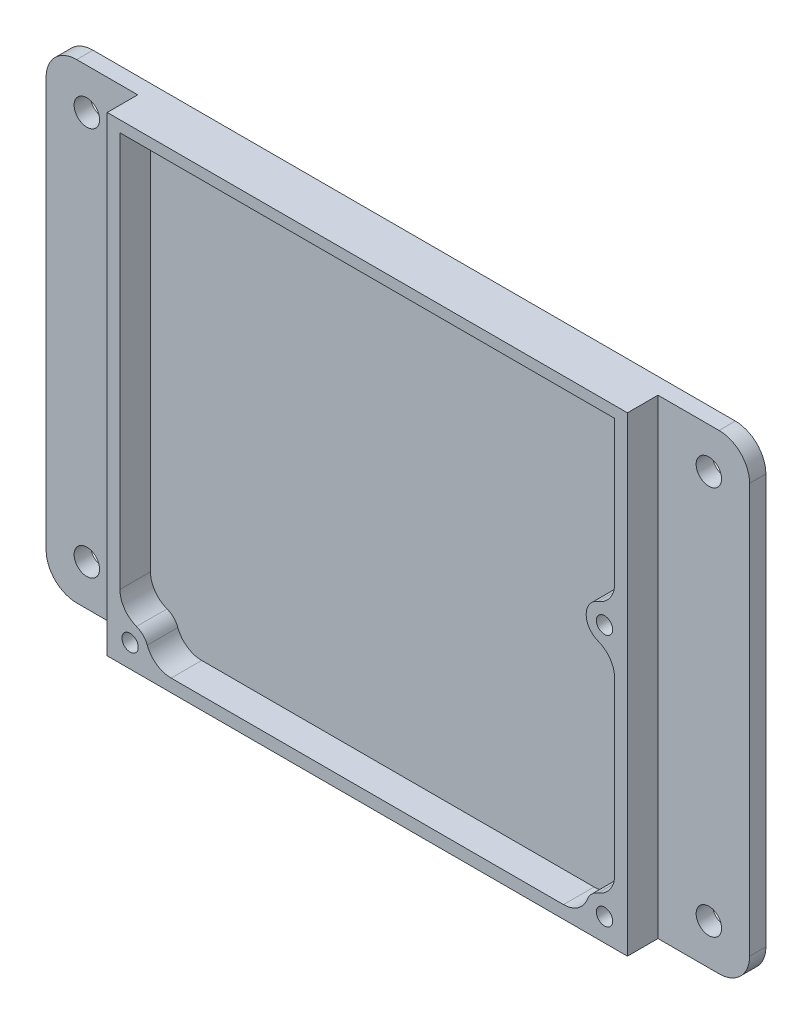
ISO-10303-21;
HEADER;
FILE_DESCRIPTION(('STEP AP214'),'2;1');
FILE_NAME('part.step','',(''),(''),'','','');
FILE_SCHEMA(('AUTOMOTIVE_DESIGN { 1 0 10303 214 1 1 1 1 }'));
ENDSEC;
DATA;
#1=APPLICATION_CONTEXT('core data for automotive mechanical design processes');
#2=APPLICATION_PROTOCOL_DEFINITION('international standard','automotive_design',2000,#1);
#3=PRODUCT_CONTEXT('',#1,'mechanical');
#4=PRODUCT('Part','Part','',(#3));
#5=PRODUCT_RELATED_PRODUCT_CATEGORY('part','',(#4));
#6=PRODUCT_DEFINITION_FORMATION('','',#4);
#7=PRODUCT_DEFINITION_CONTEXT('part definition',#1,'design');
#8=PRODUCT_DEFINITION('design','',#6,#7);
#9=PRODUCT_DEFINITION_SHAPE('','',#8);
#10=(LENGTH_UNIT() NAMED_UNIT(*) SI_UNIT(.MILLI.,.METRE.));
#11=(NAMED_UNIT(*) PLANE_ANGLE_UNIT() SI_UNIT($,.RADIAN.));
#12=(NAMED_UNIT(*) SI_UNIT($,.STERADIAN.) SOLID_ANGLE_UNIT());
#13=UNCERTAINTY_MEASURE_WITH_UNIT(LENGTH_MEASURE(1.E-05),#10,'distance_accuracy_value','');
#14=(GEOMETRIC_REPRESENTATION_CONTEXT(3) GLOBAL_UNCERTAINTY_ASSIGNED_CONTEXT((#13)) GLOBAL_UNIT_ASSIGNED_CONTEXT((#10,
#11,#12)) REPRESENTATION_CONTEXT('',''));
#15=CARTESIAN_POINT('',(0.,0.,0.));
#16=DIRECTION('',(0.,0.,1.));
#17=DIRECTION('',(1.,0.,0.));
#18=AXIS2_PLACEMENT_3D('',#15,#16,#17);
#19=CARTESIAN_POINT('',(0.,0.,6.));
#20=DIRECTION('',(0.,1.,0.));
#21=DIRECTION('',(0.,0.,1.));
#22=AXIS2_PLACEMENT_3D('',#19,#20,#21);
#23=PLANE('',#22);
#24=DIRECTION('',(-1.,0.,0.));
#25=VECTOR('',#24,1.);
#26=CARTESIAN_POINT('',(120.2,0.,-3.2));
#27=LINE('',#26,#25);
#28=CARTESIAN_POINT('',(114.2,0.,-3.2));
#29=VERTEX_POINT('',#28);
#30=CARTESIAN_POINT('',(-12.,0.,-3.2));
#31=VERTEX_POINT('',#30);
#32=EDGE_CURVE('E859',#29,#31,#27,.T.);
#33=ORIENTED_EDGE('',*,*,#32,.F.);
#34=DIRECTION('',(0.,0.,1.));
#35=VECTOR('',#34,1.);
#36=CARTESIAN_POINT('',(114.2,0.,6.));
#37=LINE('',#36,#35);
#38=CARTESIAN_POINT('',(114.2,0.,0.));
#39=VERTEX_POINT('',#38);
#40=EDGE_CURVE('E285',#29,#39,#37,.T.);
#41=ORIENTED_EDGE('',*,*,#40,.T.);
#42=DIRECTION('',(-1.,0.,0.));
#43=VECTOR('',#42,1.);
#44=CARTESIAN_POINT('',(120.2,0.,0.));
#45=LINE('',#44,#43);
#46=CARTESIAN_POINT('',(102.2,0.,0.));
#47=VERTEX_POINT('',#46);
#48=EDGE_CURVE('E869',#39,#47,#45,.T.);
#49=ORIENTED_EDGE('',*,*,#48,.T.);
#50=DIRECTION('',(0.,0.,-1.));
#51=VECTOR('',#50,1.);
#52=CARTESIAN_POINT('',(102.2,0.,6.));
#53=LINE('',#52,#51);
#54=CARTESIAN_POINT('',(102.2,0.,6.));
#55=VERTEX_POINT('',#54);
#56=EDGE_CURVE('E249',#55,#47,#53,.T.);
#57=ORIENTED_EDGE('',*,*,#56,.F.);
#58=DIRECTION('',(1.,0.,0.));
#59=VECTOR('',#58,1.);
#60=CARTESIAN_POINT('',(0.,0.,6.));
#61=LINE('',#60,#59);
#62=CARTESIAN_POINT('',(0.,0.,6.));
#63=VERTEX_POINT('',#62);
#64=EDGE_CURVE('E411',#63,#55,#61,.T.);
#65=ORIENTED_EDGE('',*,*,#64,.F.);
#66=DIRECTION('',(0.,0.,-1.));
#67=VECTOR('',#66,1.);
#68=CARTESIAN_POINT('',(0.,0.,6.));
#69=LINE('',#68,#67);
#70=CARTESIAN_POINT('',(0.,0.,0.));
#71=VERTEX_POINT('',#70);
#72=EDGE_CURVE('E246',#63,#71,#69,.T.);
#73=ORIENTED_EDGE('',*,*,#72,.T.);
#74=CARTESIAN_POINT('',(-12.,0.,0.));
#75=VERTEX_POINT('',#74);
#76=EDGE_CURVE('E235',#71,#75,#45,.T.);
#77=ORIENTED_EDGE('',*,*,#76,.T.);
#78=DIRECTION('',(0.,0.,1.));
#79=VECTOR('',#78,1.);
#80=CARTESIAN_POINT('',(-12.,0.,6.));
#81=LINE('',#80,#79);
#82=EDGE_CURVE('E283',#75,#31,#81,.F.);
#83=ORIENTED_EDGE('',*,*,#82,.T.);
#84=EDGE_LOOP('',(#33,#41,#49,#57,#65,#73,#77,#83));
#85=FACE_BOUND('',#84,.T.);
#86=ADVANCED_FACE('F41',(#85),#23,.F.);
#87=CARTESIAN_POINT('',(102.2,0.,6.));
#88=DIRECTION('',(-1.,0.,0.));
#89=DIRECTION('',(0.,0.,1.));
#90=AXIS2_PLACEMENT_3D('',#87,#88,#89);
#91=PLANE('',#90);
#92=DIRECTION('',(0.,1.,0.));
#93=VECTOR('',#92,1.);
#94=CARTESIAN_POINT('',(102.2,0.,0.));
#95=LINE('',#94,#93);
#96=CARTESIAN_POINT('',(102.2,92.45,0.));
#97=VERTEX_POINT('',#96);
#98=EDGE_CURVE('E239',#47,#97,#95,.T.);
#99=ORIENTED_EDGE('',*,*,#98,.T.);
#100=DIRECTION('',(0.,0.,-1.));
#101=VECTOR('',#100,1.);
#102=CARTESIAN_POINT('',(102.2,92.45,6.));
#103=LINE('',#102,#101);
#104=CARTESIAN_POINT('',(102.2,92.45,6.));
#105=VERTEX_POINT('',#104);
#106=EDGE_CURVE('E245',#105,#97,#103,.T.);
#107=ORIENTED_EDGE('',*,*,#106,.F.);
#108=DIRECTION('',(0.,1.,0.));
#109=VECTOR('',#108,1.);
#110=CARTESIAN_POINT('',(102.2,0.,6.));
#111=LINE('',#110,#109);
#112=EDGE_CURVE('E414',#55,#105,#111,.T.);
#113=ORIENTED_EDGE('',*,*,#112,.F.);
#114=ORIENTED_EDGE('',*,*,#56,.T.);
#115=EDGE_LOOP('',(#99,#107,#113,#114));
#116=FACE_BOUND('',#115,.T.);
#117=ADVANCED_FACE('F481',(#116),#91,.F.);
#118=CARTESIAN_POINT('',(0.,92.45,6.));
#119=DIRECTION('',(0.,1.,0.));
#120=DIRECTION('',(0.,0.,1.));
#121=AXIS2_PLACEMENT_3D('',#118,#119,#120);
#122=PLANE('',#121);
#123=DIRECTION('',(1.,0.,0.));
#124=VECTOR('',#123,1.);
#125=CARTESIAN_POINT('',(120.2,92.45,0.));
#126=LINE('',#125,#124);
#127=CARTESIAN_POINT('',(114.2,92.45,0.));
#128=VERTEX_POINT('',#127);
#129=EDGE_CURVE('E229',#97,#128,#126,.T.);
#130=ORIENTED_EDGE('',*,*,#129,.T.);
#131=DIRECTION('',(0.,0.,1.));
#132=VECTOR('',#131,1.);
#133=CARTESIAN_POINT('',(114.2,92.45,-3.2));
#134=LINE('',#133,#132);
#135=CARTESIAN_POINT('',(114.2,92.45,-3.2));
#136=VERTEX_POINT('',#135);
#137=EDGE_CURVE('E273',#128,#136,#134,.F.);
#138=ORIENTED_EDGE('',*,*,#137,.T.);
#139=DIRECTION('',(1.,0.,0.));
#140=VECTOR('',#139,1.);
#141=CARTESIAN_POINT('',(120.2,92.45,-3.2));
#142=LINE('',#141,#140);
#143=CARTESIAN_POINT('',(-12.,92.45,-3.2));
#144=VERTEX_POINT('',#143);
#145=EDGE_CURVE('E428',#144,#136,#142,.T.);
#146=ORIENTED_EDGE('',*,*,#145,.F.);
#147=DIRECTION('',(0.,0.,1.));
#148=VECTOR('',#147,1.);
#149=CARTESIAN_POINT('',(-12.,92.45,0.));
#150=LINE('',#149,#148);
#151=CARTESIAN_POINT('',(-12.,92.45,0.));
#152=VERTEX_POINT('',#151);
#153=EDGE_CURVE('E226',#144,#152,#150,.T.);
#154=ORIENTED_EDGE('',*,*,#153,.T.);
#155=CARTESIAN_POINT('',(0.,92.45,0.));
#156=VERTEX_POINT('',#155);
#157=EDGE_CURVE('E216',#152,#156,#126,.T.);
#158=ORIENTED_EDGE('',*,*,#157,.T.);
#159=DIRECTION('',(0.,0.,-1.));
#160=VECTOR('',#159,1.);
#161=CARTESIAN_POINT('',(0.,92.45,6.));
#162=LINE('',#161,#160);
#163=CARTESIAN_POINT('',(0.,92.45,6.));
#164=VERTEX_POINT('',#163);
#165=EDGE_CURVE('E222',#164,#156,#162,.T.);
#166=ORIENTED_EDGE('',*,*,#165,.F.);
#167=DIRECTION('',(1.,0.,0.));
#168=VECTOR('',#167,1.);
#169=CARTESIAN_POINT('',(0.,92.45,6.));
#170=LINE('',#169,#168);
#171=EDGE_CURVE('E416',#164,#105,#170,.T.);
#172=ORIENTED_EDGE('',*,*,#171,.T.);
#173=ORIENTED_EDGE('',*,*,#106,.T.);
#174=EDGE_LOOP('',(#130,#138,#146,#154,#158,#166,#172,#173));
#175=FACE_BOUND('',#174,.T.);
#176=ADVANCED_FACE('F219',(#175),#122,.T.);
#177=CARTESIAN_POINT('',(4.5,4.5,6.));
#178=DIRECTION('',(0.,0.,-1.));
#179=DIRECTION('',(-1.,0.,0.));
#180=AXIS2_PLACEMENT_3D('',#177,#178,#179);
#181=CYLINDRICAL_SURFACE('',#180,3.6);
#182=CARTESIAN_POINT('',(4.5,4.5,6.));
#183=DIRECTION('',(0.,0.,1.));
#184=DIRECTION('',(1.,0.,0.));
#185=AXIS2_PLACEMENT_3D('',#182,#183,#184);
#186=CIRCLE('',#185,3.6);
#187=CARTESIAN_POINT('',(7.87386000216723,5.75581395348837,6.));
#188=VERTEX_POINT('',#187);
#189=CARTESIAN_POINT('',(5.75581395348837,7.87386000216723,6.));
#190=VERTEX_POINT('',#189);
#191=EDGE_CURVE('E388',#188,#190,#186,.T.);
#192=ORIENTED_EDGE('',*,*,#191,.F.);
#193=DIRECTION('',(0.,0.,-1.));
#194=VECTOR('',#193,1.);
#195=CARTESIAN_POINT('',(7.87386000216724,5.75581395348837,6.));
#196=LINE('',#195,#194);
#197=CARTESIAN_POINT('',(7.87386000216723,5.75581395348837,0.));
#198=VERTEX_POINT('',#197);
#199=EDGE_CURVE('E318',#188,#198,#196,.T.);
#200=ORIENTED_EDGE('',*,*,#199,.T.);
#201=CARTESIAN_POINT('',(4.5,4.5,0.));
#202=DIRECTION('',(0.,0.,1.));
#203=DIRECTION('',(1.,0.,0.));
#204=AXIS2_PLACEMENT_3D('',#201,#202,#203);
#205=CIRCLE('',#204,3.6);
#206=CARTESIAN_POINT('',(5.75581395348837,7.87386000216723,0.));
#207=VERTEX_POINT('',#206);
#208=EDGE_CURVE('E424',#198,#207,#205,.T.);
#209=ORIENTED_EDGE('',*,*,#208,.T.);
#210=DIRECTION('',(0.,0.,-1.));
#211=VECTOR('',#210,1.);
#212=CARTESIAN_POINT('',(5.75581395348837,7.87386000216724,6.));
#213=LINE('',#212,#211);
#214=EDGE_CURVE('E316',#207,#190,#213,.F.);
#215=ORIENTED_EDGE('',*,*,#214,.T.);
#216=EDGE_LOOP('',(#192,#200,#209,#215));
#217=FACE_BOUND('',#216,.T.);
#218=ADVANCED_FACE('F468',(#217),#181,.T.);
#219=CARTESIAN_POINT('',(2.5,0.,6.));
#220=DIRECTION('',(-1.,0.,0.));
#221=DIRECTION('',(0.,0.,1.));
#222=AXIS2_PLACEMENT_3D('',#219,#220,#221);
#223=PLANE('',#222);
#224=DIRECTION('',(0.,1.,0.));
#225=VECTOR('',#224,1.);
#226=CARTESIAN_POINT('',(2.5,0.,6.));
#227=LINE('',#226,#225);
#228=CARTESIAN_POINT('',(2.5,12.559776671844,6.));
#229=VERTEX_POINT('',#228);
#230=CARTESIAN_POINT('',(2.5,90.25,6.));
#231=VERTEX_POINT('',#230);
#232=EDGE_CURVE('E392',#229,#231,#227,.T.);
#233=ORIENTED_EDGE('',*,*,#232,.F.);
#234=DIRECTION('',(0.,0.,1.));
#235=VECTOR('',#234,1.);
#236=CARTESIAN_POINT('',(2.5,12.559776671844,0.));
#237=LINE('',#236,#235);
#238=CARTESIAN_POINT('',(2.5,12.559776671844,0.));
#239=VERTEX_POINT('',#238);
#240=EDGE_CURVE('E334',#229,#239,#237,.F.);
#241=ORIENTED_EDGE('',*,*,#240,.T.);
#242=DIRECTION('',(0.,1.,0.));
#243=VECTOR('',#242,1.);
#244=CARTESIAN_POINT('',(2.5,0.,0.));
#245=LINE('',#244,#243);
#246=CARTESIAN_POINT('',(2.5,90.25,0.));
#247=VERTEX_POINT('',#246);
#248=EDGE_CURVE('E427',#239,#247,#245,.T.);
#249=ORIENTED_EDGE('',*,*,#248,.T.);
#250=DIRECTION('',(0.,0.,-1.));
#251=VECTOR('',#250,1.);
#252=CARTESIAN_POINT('',(2.5,90.25,6.));
#253=LINE('',#252,#251);
#254=EDGE_CURVE('E251',#231,#247,#253,.T.);
#255=ORIENTED_EDGE('',*,*,#254,.F.);
#256=EDGE_LOOP('',(#233,#241,#249,#255));
#257=FACE_BOUND('',#256,.T.);
#258=ADVANCED_FACE('F462',(#257),#223,.F.);
#259=CARTESIAN_POINT('',(0.,90.25,6.));
#260=DIRECTION('',(0.,1.,0.));
#261=DIRECTION('',(0.,0.,1.));
#262=AXIS2_PLACEMENT_3D('',#259,#260,#261);
#263=PLANE('',#262);
#264=DIRECTION('',(1.,0.,0.));
#265=VECTOR('',#264,1.);
#266=CARTESIAN_POINT('',(0.,90.25,0.));
#267=LINE('',#266,#265);
#268=CARTESIAN_POINT('',(99.7,90.25,0.));
#269=VERTEX_POINT('',#268);
#270=EDGE_CURVE('E430',#247,#269,#267,.T.);
#271=ORIENTED_EDGE('',*,*,#270,.T.);
#272=DIRECTION('',(0.,0.,-1.));
#273=VECTOR('',#272,1.);
#274=CARTESIAN_POINT('',(99.7,90.25,6.));
#275=LINE('',#274,#273);
#276=CARTESIAN_POINT('',(99.7,90.25,6.));
#277=VERTEX_POINT('',#276);
#278=EDGE_CURVE('E258',#277,#269,#275,.T.);
#279=ORIENTED_EDGE('',*,*,#278,.F.);
#280=DIRECTION('',(1.,0.,0.));
#281=VECTOR('',#280,1.);
#282=CARTESIAN_POINT('',(0.,90.25,6.));
#283=LINE('',#282,#281);
#284=EDGE_CURVE('E396',#231,#277,#283,.T.);
#285=ORIENTED_EDGE('',*,*,#284,.F.);
#286=ORIENTED_EDGE('',*,*,#254,.T.);
#287=EDGE_LOOP('',(#271,#279,#285,#286));
#288=FACE_BOUND('',#287,.T.);
#289=ADVANCED_FACE('F457',(#288),#263,.F.);
#290=CARTESIAN_POINT('',(99.7,0.,6.));
#291=DIRECTION('',(-1.,0.,0.));
#292=DIRECTION('',(0.,0.,1.));
#293=AXIS2_PLACEMENT_3D('',#290,#291,#292);
#294=PLANE('',#293);
#295=DIRECTION('',(0.,1.,0.));
#296=VECTOR('',#295,1.);
#297=CARTESIAN_POINT('',(99.7,0.,0.));
#298=LINE('',#297,#296);
#299=CARTESIAN_POINT('',(99.7,62.159776671844,0.));
#300=VERTEX_POINT('',#299);
#301=EDGE_CURVE('E378',#300,#269,#298,.T.);
#302=ORIENTED_EDGE('',*,*,#301,.F.);
#303=DIRECTION('',(0.,0.,-1.));
#304=VECTOR('',#303,1.);
#305=CARTESIAN_POINT('',(99.7,62.159776671844,6.));
#306=LINE('',#305,#304);
#307=CARTESIAN_POINT('',(99.7,62.159776671844,6.));
#308=VERTEX_POINT('',#307);
#309=EDGE_CURVE('E306',#300,#308,#306,.F.);
#310=ORIENTED_EDGE('',*,*,#309,.T.);
#311=DIRECTION('',(0.,1.,0.));
#312=VECTOR('',#311,1.);
#313=CARTESIAN_POINT('',(99.7,0.,6.));
#314=LINE('',#313,#312);
#315=EDGE_CURVE('E402',#308,#277,#314,.T.);
#316=ORIENTED_EDGE('',*,*,#315,.T.);
#317=ORIENTED_EDGE('',*,*,#278,.T.);
#318=EDGE_LOOP('',(#302,#310,#316,#317));
#319=FACE_BOUND('',#318,.T.);
#320=ADVANCED_FACE('F453',(#319),#294,.T.);
#321=CARTESIAN_POINT('',(97.7,54.1,6.));
#322=DIRECTION('',(0.,0.,-1.));
#323=DIRECTION('',(-1.,0.,0.));
#324=AXIS2_PLACEMENT_3D('',#321,#322,#323);
#325=CYLINDRICAL_SURFACE('',#324,3.6);
#326=CARTESIAN_POINT('',(97.7,54.1,6.));
#327=DIRECTION('',(0.,0.,1.));
#328=DIRECTION('',(1.,0.,0.));
#329=AXIS2_PLACEMENT_3D('',#326,#327,#328);
#330=CIRCLE('',#329,3.6);
#331=CARTESIAN_POINT('',(96.4441860465116,57.4738600021672,6.));
#332=VERTEX_POINT('',#331);
#333=CARTESIAN_POINT('',(96.4441860465116,50.7261399978328,6.));
#334=VERTEX_POINT('',#333);
#335=EDGE_CURVE('E404',#332,#334,#330,.T.);
#336=ORIENTED_EDGE('',*,*,#335,.F.);
#337=DIRECTION('',(0.,0.,-1.));
#338=VECTOR('',#337,1.);
#339=CARTESIAN_POINT('',(96.4441860465116,57.4738600021672,6.));
#340=LINE('',#339,#338);
#341=CARTESIAN_POINT('',(96.4441860465116,57.4738600021672,0.));
#342=VERTEX_POINT('',#341);
#343=EDGE_CURVE('E299',#332,#342,#340,.T.);
#344=ORIENTED_EDGE('',*,*,#343,.T.);
#345=CARTESIAN_POINT('',(97.7,54.1,0.));
#346=DIRECTION('',(0.,0.,1.));
#347=DIRECTION('',(1.,0.,0.));
#348=AXIS2_PLACEMENT_3D('',#345,#346,#347);
#349=CIRCLE('',#348,3.6);
#350=CARTESIAN_POINT('',(96.4441860465116,50.7261399978328,0.));
#351=VERTEX_POINT('',#350);
#352=EDGE_CURVE('E376',#342,#351,#349,.T.);
#353=ORIENTED_EDGE('',*,*,#352,.T.);
#354=DIRECTION('',(0.,0.,-1.));
#355=VECTOR('',#354,1.);
#356=CARTESIAN_POINT('',(96.4441860465116,50.7261399978328,6.));
#357=LINE('',#356,#355);
#358=EDGE_CURVE('E297',#351,#334,#357,.F.);
#359=ORIENTED_EDGE('',*,*,#358,.T.);
#360=EDGE_LOOP('',(#336,#344,#353,#359));
#361=FACE_BOUND('',#360,.T.);
#362=ADVANCED_FACE('F439',(#361),#325,.T.);
#363=CARTESIAN_POINT('',(99.7,12.559776671844,0.));
#364=VERTEX_POINT('',#363);
#365=CARTESIAN_POINT('',(99.7,46.040223328156,0.));
#366=VERTEX_POINT('',#365);
#367=EDGE_CURVE('E372',#364,#366,#298,.T.);
#368=ORIENTED_EDGE('',*,*,#367,.F.);
#369=DIRECTION('',(0.,0.,-1.));
#370=VECTOR('',#369,1.);
#371=CARTESIAN_POINT('',(99.7,12.559776671844,6.));
#372=LINE('',#371,#370);
#373=CARTESIAN_POINT('',(99.7,12.559776671844,6.));
#374=VERTEX_POINT('',#373);
#375=EDGE_CURVE('E56',#364,#374,#372,.F.);
#376=ORIENTED_EDGE('',*,*,#375,.T.);
#377=CARTESIAN_POINT('',(99.7,46.040223328156,6.));
#378=VERTEX_POINT('',#377);
#379=EDGE_CURVE('E405',#374,#378,#314,.T.);
#380=ORIENTED_EDGE('',*,*,#379,.T.);
#381=DIRECTION('',(0.,0.,-1.));
#382=VECTOR('',#381,1.);
#383=CARTESIAN_POINT('',(99.7,46.040223328156,6.));
#384=LINE('',#383,#382);
#385=EDGE_CURVE('E308',#378,#366,#384,.T.);
#386=ORIENTED_EDGE('',*,*,#385,.T.);
#387=EDGE_LOOP('',(#368,#376,#380,#386));
#388=FACE_BOUND('',#387,.T.);
#389=ADVANCED_FACE('F502',(#388),#294,.T.);
#390=CARTESIAN_POINT('',(97.7,4.5,6.));
#391=DIRECTION('',(0.,0.,-1.));
#392=DIRECTION('',(-1.,0.,0.));
#393=AXIS2_PLACEMENT_3D('',#390,#391,#392);
#394=CYLINDRICAL_SURFACE('',#393,3.6);
#395=CARTESIAN_POINT('',(97.7,4.5,0.));
#396=DIRECTION('',(0.,0.,1.));
#397=DIRECTION('',(1.,0.,0.));
#398=AXIS2_PLACEMENT_3D('',#395,#396,#397);
#399=CIRCLE('',#398,3.6);
#400=CARTESIAN_POINT('',(96.4441860465116,7.87386000216723,0.));
#401=VERTEX_POINT('',#400);
#402=CARTESIAN_POINT('',(94.3261399978328,5.75581395348837,0.));
#403=VERTEX_POINT('',#402);
#404=EDGE_CURVE('E368',#401,#403,#399,.T.);
#405=ORIENTED_EDGE('',*,*,#404,.T.);
#406=DIRECTION('',(0.,0.,-1.));
#407=VECTOR('',#406,1.);
#408=CARTESIAN_POINT('',(94.3261399978328,5.75581395348837,6.));
#409=LINE('',#408,#407);
#410=CARTESIAN_POINT('',(94.3261399978328,5.75581395348837,6.));
#411=VERTEX_POINT('',#410);
#412=EDGE_CURVE('E64',#403,#411,#409,.F.);
#413=ORIENTED_EDGE('',*,*,#412,.T.);
#414=CARTESIAN_POINT('',(97.7,4.5,6.));
#415=DIRECTION('',(0.,0.,1.));
#416=DIRECTION('',(1.,0.,0.));
#417=AXIS2_PLACEMENT_3D('',#414,#415,#416);
#418=CIRCLE('',#417,3.6);
#419=CARTESIAN_POINT('',(96.4441860465116,7.87386000216723,6.));
#420=VERTEX_POINT('',#419);
#421=EDGE_CURVE('E353',#420,#411,#418,.T.);
#422=ORIENTED_EDGE('',*,*,#421,.F.);
#423=DIRECTION('',(0.,0.,-1.));
#424=VECTOR('',#423,1.);
#425=CARTESIAN_POINT('',(96.4441860465116,7.87386000216723,6.));
#426=LINE('',#425,#424);
#427=EDGE_CURVE('E337',#420,#401,#426,.T.);
#428=ORIENTED_EDGE('',*,*,#427,.T.);
#429=EDGE_LOOP('',(#405,#413,#422,#428));
#430=FACE_BOUND('',#429,.T.);
#431=ADVANCED_FACE('F370',(#430),#394,.T.);
#432=CARTESIAN_POINT('',(4.5,4.5,6.));
#433=DIRECTION('',(0.,0.,-1.));
#434=DIRECTION('',(-1.,0.,0.));
#435=AXIS2_PLACEMENT_3D('',#432,#433,#434);
#436=CYLINDRICAL_SURFACE('',#435,1.6);
#437=CARTESIAN_POINT('',(4.5,4.5,6.));
#438=DIRECTION('',(0.,0.,1.));
#439=DIRECTION('',(1.,0.,0.));
#440=AXIS2_PLACEMENT_3D('',#437,#438,#439);
#441=CIRCLE('',#440,1.6);
#442=CARTESIAN_POINT('',(6.1,4.5,6.));
#443=VERTEX_POINT('',#442);
#444=EDGE_CURVE('E419',#443,#443,#441,.T.);
#445=ORIENTED_EDGE('',*,*,#444,.T.);
#446=EDGE_LOOP('',(#445));
#447=FACE_BOUND('',#446,.T.);
#448=CARTESIAN_POINT('',(4.5,4.5,0.));
#449=DIRECTION('',(0.,0.,1.));
#450=DIRECTION('',(1.,0.,0.));
#451=AXIS2_PLACEMENT_3D('',#448,#449,#450);
#452=CIRCLE('',#451,1.6);
#453=CARTESIAN_POINT('',(6.1,4.5,0.));
#454=VERTEX_POINT('',#453);
#455=EDGE_CURVE('E238',#454,#454,#452,.T.);
#456=ORIENTED_EDGE('',*,*,#455,.F.);
#457=EDGE_LOOP('',(#456));
#458=FACE_BOUND('',#457,.T.);
#459=ADVANCED_FACE('F501',(#447,#458),#436,.F.);
#460=CARTESIAN_POINT('',(0.,0.,6.));
#461=DIRECTION('',(-1.,0.,0.));
#462=DIRECTION('',(0.,0.,1.));
#463=AXIS2_PLACEMENT_3D('',#460,#461,#462);
#464=PLANE('',#463);
#465=DIRECTION('',(0.,1.,0.));
#466=VECTOR('',#465,1.);
#467=CARTESIAN_POINT('',(0.,0.,0.));
#468=LINE('',#467,#466);
#469=EDGE_CURVE('E232',#71,#156,#468,.T.);
#470=ORIENTED_EDGE('',*,*,#469,.F.);
#471=ORIENTED_EDGE('',*,*,#72,.F.);
#472=DIRECTION('',(0.,1.,0.));
#473=VECTOR('',#472,1.);
#474=CARTESIAN_POINT('',(0.,0.,6.));
#475=LINE('',#474,#473);
#476=EDGE_CURVE('E244',#63,#164,#475,.T.);
#477=ORIENTED_EDGE('',*,*,#476,.T.);
#478=ORIENTED_EDGE('',*,*,#165,.T.);
#479=EDGE_LOOP('',(#470,#471,#477,#478));
#480=FACE_BOUND('',#479,.T.);
#481=ADVANCED_FACE('F242',(#480),#464,.T.);
#482=CARTESIAN_POINT('',(97.7,54.1,6.));
#483=DIRECTION('',(0.,0.,-1.));
#484=DIRECTION('',(-1.,0.,0.));
#485=AXIS2_PLACEMENT_3D('',#482,#483,#484);
#486=CYLINDRICAL_SURFACE('',#485,1.60000000000001);
#487=CARTESIAN_POINT('',(97.7,54.1,6.));
#488=DIRECTION('',(0.,0.,1.));
#489=DIRECTION('',(1.,0.,0.));
#490=AXIS2_PLACEMENT_3D('',#487,#488,#489);
#491=CIRCLE('',#490,1.60000000000001);
#492=CARTESIAN_POINT('',(99.3,54.1,6.));
#493=VERTEX_POINT('',#492);
#494=EDGE_CURVE('E361',#493,#493,#491,.T.);
#495=ORIENTED_EDGE('',*,*,#494,.T.);
#496=EDGE_LOOP('',(#495));
#497=FACE_BOUND('',#496,.T.);
#498=CARTESIAN_POINT('',(97.7,54.1,0.));
#499=DIRECTION('',(0.,0.,1.));
#500=DIRECTION('',(1.,0.,0.));
#501=AXIS2_PLACEMENT_3D('',#498,#499,#500);
#502=CIRCLE('',#501,1.60000000000001);
#503=CARTESIAN_POINT('',(99.3,54.1,0.));
#504=VERTEX_POINT('',#503);
#505=EDGE_CURVE('E374',#504,#504,#502,.T.);
#506=ORIENTED_EDGE('',*,*,#505,.F.);
#507=EDGE_LOOP('',(#506));
#508=FACE_BOUND('',#507,.T.);
#509=ADVANCED_FACE('F492',(#497,#508),#486,.F.);
#510=CARTESIAN_POINT('',(0.,2.5,6.));
#511=DIRECTION('',(0.,1.,0.));
#512=DIRECTION('',(-1.,0.,0.));
#513=AXIS2_PLACEMENT_3D('',#510,#511,#512);
#514=PLANE('',#513);
#515=DIRECTION('',(1.,0.,0.));
#516=VECTOR('',#515,1.);
#517=CARTESIAN_POINT('',(0.,2.5,0.));
#518=LINE('',#517,#516);
#519=CARTESIAN_POINT('',(12.559776671844,2.5,0.));
#520=VERTEX_POINT('',#519);
#521=CARTESIAN_POINT('',(89.640223328156,2.5,0.));
#522=VERTEX_POINT('',#521);
#523=EDGE_CURVE('E369',#520,#522,#518,.T.);
#524=ORIENTED_EDGE('',*,*,#523,.F.);
#525=DIRECTION('',(0.,0.,-1.));
#526=VECTOR('',#525,1.);
#527=CARTESIAN_POINT('',(12.559776671844,2.5,6.));
#528=LINE('',#527,#526);
#529=CARTESIAN_POINT('',(12.559776671844,2.5,6.));
#530=VERTEX_POINT('',#529);
#531=EDGE_CURVE('E332',#520,#530,#528,.F.);
#532=ORIENTED_EDGE('',*,*,#531,.T.);
#533=DIRECTION('',(1.,0.,0.));
#534=VECTOR('',#533,1.);
#535=CARTESIAN_POINT('',(0.,2.5,6.));
#536=LINE('',#535,#534);
#537=CARTESIAN_POINT('',(89.640223328156,2.5,6.));
#538=VERTEX_POINT('',#537);
#539=EDGE_CURVE('E351',#530,#538,#536,.T.);
#540=ORIENTED_EDGE('',*,*,#539,.T.);
#541=DIRECTION('',(0.,0.,-1.));
#542=VECTOR('',#541,1.);
#543=CARTESIAN_POINT('',(89.640223328156,2.5,6.));
#544=LINE('',#543,#542);
#545=EDGE_CURVE('E329',#538,#522,#544,.T.);
#546=ORIENTED_EDGE('',*,*,#545,.T.);
#547=EDGE_LOOP('',(#524,#532,#540,#546));
#548=FACE_BOUND('',#547,.T.);
#549=ADVANCED_FACE('F358',(#548),#514,.T.);
#550=CARTESIAN_POINT('',(97.7,4.5,6.));
#551=DIRECTION('',(0.,0.,-1.));
#552=DIRECTION('',(-1.,0.,0.));
#553=AXIS2_PLACEMENT_3D('',#550,#551,#552);
#554=CYLINDRICAL_SURFACE('',#553,1.60000000000001);
#555=CARTESIAN_POINT('',(97.7,4.5,6.));
#556=DIRECTION('',(0.,0.,1.));
#557=DIRECTION('',(1.,0.,0.));
#558=AXIS2_PLACEMENT_3D('',#555,#556,#557);
#559=CIRCLE('',#558,1.60000000000001);
#560=CARTESIAN_POINT('',(99.3,4.5,6.));
#561=VERTEX_POINT('',#560);
#562=EDGE_CURVE('E261',#561,#561,#559,.T.);
#563=ORIENTED_EDGE('',*,*,#562,.T.);
#564=EDGE_LOOP('',(#563));
#565=FACE_BOUND('',#564,.T.);
#566=CARTESIAN_POINT('',(97.7,4.5,0.));
#567=DIRECTION('',(0.,0.,1.));
#568=DIRECTION('',(1.,0.,0.));
#569=AXIS2_PLACEMENT_3D('',#566,#567,#568);
#570=CIRCLE('',#569,1.60000000000001);
#571=CARTESIAN_POINT('',(99.3,4.5,0.));
#572=VERTEX_POINT('',#571);
#573=EDGE_CURVE('E386',#572,#572,#570,.T.);
#574=ORIENTED_EDGE('',*,*,#573,.F.);
#575=EDGE_LOOP('',(#574));
#576=FACE_BOUND('',#575,.T.);
#577=ADVANCED_FACE('F498',(#565,#576),#554,.F.);
#578=CARTESIAN_POINT('',(0.,0.,6.));
#579=DIRECTION('',(0.,0.,1.));
#580=DIRECTION('',(1.,0.,0.));
#581=AXIS2_PLACEMENT_3D('',#578,#579,#580);
#582=PLANE('',#581);
#583=ORIENTED_EDGE('',*,*,#539,.F.);
#584=CARTESIAN_POINT('',(12.559776671844,7.5,6.));
#585=DIRECTION('',(0.,0.,1.));
#586=DIRECTION('',(1.,0.,0.));
#587=AXIS2_PLACEMENT_3D('',#584,#585,#586);
#588=CIRCLE('',#587,5.);
#589=EDGE_CURVE('E342',#530,#188,#588,.F.);
#590=ORIENTED_EDGE('',*,*,#589,.T.);
#591=ORIENTED_EDGE('',*,*,#191,.T.);
#592=CARTESIAN_POINT('',(7.5,12.559776671844,6.));
#593=DIRECTION('',(0.,0.,1.));
#594=DIRECTION('',(1.,0.,0.));
#595=AXIS2_PLACEMENT_3D('',#592,#593,#594);
#596=CIRCLE('',#595,5.);
#597=EDGE_CURVE('E344',#190,#229,#596,.F.);
#598=ORIENTED_EDGE('',*,*,#597,.T.);
#599=ORIENTED_EDGE('',*,*,#232,.T.);
#600=ORIENTED_EDGE('',*,*,#284,.T.);
#601=ORIENTED_EDGE('',*,*,#315,.F.);
#602=CARTESIAN_POINT('',(94.7,62.159776671844,6.));
#603=DIRECTION('',(0.,0.,1.));
#604=DIRECTION('',(1.,0.,0.));
#605=AXIS2_PLACEMENT_3D('',#602,#603,#604);
#606=CIRCLE('',#605,5.);
#607=EDGE_CURVE('E311',#308,#332,#606,.F.);
#608=ORIENTED_EDGE('',*,*,#607,.T.);
#609=ORIENTED_EDGE('',*,*,#335,.T.);
#610=CARTESIAN_POINT('',(94.7,46.040223328156,6.));
#611=DIRECTION('',(0.,0.,1.));
#612=DIRECTION('',(1.,0.,0.));
#613=AXIS2_PLACEMENT_3D('',#610,#611,#612);
#614=CIRCLE('',#613,5.);
#615=EDGE_CURVE('E313',#334,#378,#614,.F.);
#616=ORIENTED_EDGE('',*,*,#615,.T.);
#617=ORIENTED_EDGE('',*,*,#379,.F.);
#618=CARTESIAN_POINT('',(94.7,12.559776671844,6.));
#619=DIRECTION('',(0.,0.,1.));
#620=DIRECTION('',(1.,0.,0.));
#621=AXIS2_PLACEMENT_3D('',#618,#619,#620);
#622=CIRCLE('',#621,5.);
#623=EDGE_CURVE('E11',#374,#420,#622,.F.);
#624=ORIENTED_EDGE('',*,*,#623,.T.);
#625=ORIENTED_EDGE('',*,*,#421,.T.);
#626=CARTESIAN_POINT('',(89.640223328156,7.5,6.));
#627=DIRECTION('',(0.,0.,1.));
#628=DIRECTION('',(1.,0.,0.));
#629=AXIS2_PLACEMENT_3D('',#626,#627,#628);
#630=CIRCLE('',#629,5.);
#631=EDGE_CURVE('E49',#411,#538,#630,.F.);
#632=ORIENTED_EDGE('',*,*,#631,.T.);
#633=EDGE_LOOP('',(#583,#590,#591,#598,#599,#600,#601,#608,#609,#616,#617,#624,#625,#632));
#634=FACE_BOUND('',#633,.T.);
#635=ORIENTED_EDGE('',*,*,#494,.F.);
#636=EDGE_LOOP('',(#635));
#637=FACE_BOUND('',#636,.T.);
#638=ORIENTED_EDGE('',*,*,#64,.T.);
#639=ORIENTED_EDGE('',*,*,#112,.T.);
#640=ORIENTED_EDGE('',*,*,#171,.F.);
#641=ORIENTED_EDGE('',*,*,#476,.F.);
#642=EDGE_LOOP('',(#638,#639,#640,#641));
#643=FACE_BOUND('',#642,.T.);
#644=ORIENTED_EDGE('',*,*,#444,.F.);
#645=EDGE_LOOP('',(#644));
#646=FACE_BOUND('',#645,.T.);
#647=ORIENTED_EDGE('',*,*,#562,.F.);
#648=EDGE_LOOP('',(#647));
#649=FACE_BOUND('',#648,.T.);
#650=ADVANCED_FACE('F349',(#634,#637,#643,#646,#649),#582,.T.);
#651=CARTESIAN_POINT('',(0.,0.,0.));
#652=DIRECTION('',(0.,0.,1.));
#653=DIRECTION('',(1.,0.,0.));
#654=AXIS2_PLACEMENT_3D('',#651,#652,#653);
#655=PLANE('',#654);
#656=ORIENTED_EDGE('',*,*,#573,.T.);
#657=EDGE_LOOP('',(#656));
#658=FACE_BOUND('',#657,.T.);
#659=ADVANCED_FACE('F588',(#658),#655,.T.);
#660=ORIENTED_EDGE('',*,*,#455,.T.);
#661=EDGE_LOOP('',(#660));
#662=FACE_BOUND('',#661,.T.);
#663=ADVANCED_FACE('F601',(#662),#655,.T.);
#664=CARTESIAN_POINT('',(-9.99999999999999,84.45,-3.2));
#665=DIRECTION('',(0.,0.,1.));
#666=DIRECTION('',(1.,0.,0.));
#667=AXIS2_PLACEMENT_3D('',#664,#665,#666);
#668=CYLINDRICAL_SURFACE('',#667,2.5);
#669=CARTESIAN_POINT('',(-9.99999999999999,84.45,-3.2));
#670=DIRECTION('',(0.,0.,-1.));
#671=DIRECTION('',(1.,0.,0.));
#672=AXIS2_PLACEMENT_3D('',#669,#670,#671);
#673=CIRCLE('',#672,2.5);
#674=CARTESIAN_POINT('',(-7.49999999999999,84.45,-3.2));
#675=VERTEX_POINT('',#674);
#676=EDGE_CURVE('E835',#675,#675,#673,.T.);
#677=ORIENTED_EDGE('',*,*,#676,.T.);
#678=EDGE_LOOP('',(#677));
#679=FACE_BOUND('',#678,.T.);
#680=CARTESIAN_POINT('',(-9.99999999999999,84.45,0.));
#681=DIRECTION('',(0.,0.,-1.));
#682=DIRECTION('',(1.,0.,0.));
#683=AXIS2_PLACEMENT_3D('',#680,#681,#682);
#684=CIRCLE('',#683,2.5);
#685=CARTESIAN_POINT('',(-7.49999999999999,84.45,0.));
#686=VERTEX_POINT('',#685);
#687=EDGE_CURVE('E833',#686,#686,#684,.T.);
#688=ORIENTED_EDGE('',*,*,#687,.F.);
#689=EDGE_LOOP('',(#688));
#690=FACE_BOUND('',#689,.T.);
#691=ADVANCED_FACE('F694',(#679,#690),#668,.F.);
#692=CARTESIAN_POINT('',(-10.,8.00000000000002,-3.2));
#693=DIRECTION('',(0.,0.,1.));
#694=DIRECTION('',(1.,0.,0.));
#695=AXIS2_PLACEMENT_3D('',#692,#693,#694);
#696=CYLINDRICAL_SURFACE('',#695,2.5);
#697=CARTESIAN_POINT('',(-10.,8.00000000000002,-3.2));
#698=DIRECTION('',(0.,0.,-1.));
#699=DIRECTION('',(1.,0.,0.));
#700=AXIS2_PLACEMENT_3D('',#697,#698,#699);
#701=CIRCLE('',#700,2.5);
#702=CARTESIAN_POINT('',(-7.50000000000001,8.00000000000002,-3.2));
#703=VERTEX_POINT('',#702);
#704=EDGE_CURVE('E840',#703,#703,#701,.T.);
#705=ORIENTED_EDGE('',*,*,#704,.T.);
#706=EDGE_LOOP('',(#705));
#707=FACE_BOUND('',#706,.T.);
#708=CARTESIAN_POINT('',(-10.,8.00000000000002,0.));
#709=DIRECTION('',(0.,0.,-1.));
#710=DIRECTION('',(1.,0.,0.));
#711=AXIS2_PLACEMENT_3D('',#708,#709,#710);
#712=CIRCLE('',#711,2.5);
#713=CARTESIAN_POINT('',(-7.50000000000001,8.00000000000002,0.));
#714=VERTEX_POINT('',#713);
#715=EDGE_CURVE('E830',#714,#714,#712,.T.);
#716=ORIENTED_EDGE('',*,*,#715,.F.);
#717=EDGE_LOOP('',(#716));
#718=FACE_BOUND('',#717,.T.);
#719=ADVANCED_FACE('F703',(#707,#718),#696,.F.);
#720=CARTESIAN_POINT('',(112.2,8.,-3.2));
#721=DIRECTION('',(0.,0.,1.));
#722=DIRECTION('',(1.,0.,0.));
#723=AXIS2_PLACEMENT_3D('',#720,#721,#722);
#724=CYLINDRICAL_SURFACE('',#723,2.5);
#725=CARTESIAN_POINT('',(112.2,8.,-3.2));
#726=DIRECTION('',(0.,0.,-1.));
#727=DIRECTION('',(-1.,0.,0.));
#728=AXIS2_PLACEMENT_3D('',#725,#726,#727);
#729=CIRCLE('',#728,2.5);
#730=CARTESIAN_POINT('',(109.7,8.,-3.2));
#731=VERTEX_POINT('',#730);
#732=EDGE_CURVE('E845',#731,#731,#729,.T.);
#733=ORIENTED_EDGE('',*,*,#732,.T.);
#734=EDGE_LOOP('',(#733));
#735=FACE_BOUND('',#734,.T.);
#736=CARTESIAN_POINT('',(112.2,8.,0.));
#737=DIRECTION('',(0.,0.,-1.));
#738=DIRECTION('',(-1.,0.,0.));
#739=AXIS2_PLACEMENT_3D('',#736,#737,#738);
#740=CIRCLE('',#739,2.5);
#741=CARTESIAN_POINT('',(109.7,8.,0.));
#742=VERTEX_POINT('',#741);
#743=EDGE_CURVE('E843',#742,#742,#740,.T.);
#744=ORIENTED_EDGE('',*,*,#743,.F.);
#745=EDGE_LOOP('',(#744));
#746=FACE_BOUND('',#745,.T.);
#747=ADVANCED_FACE('F713',(#735,#746),#724,.F.);
#748=CARTESIAN_POINT('',(112.2,84.45,-3.2));
#749=DIRECTION('',(0.,0.,1.));
#750=DIRECTION('',(1.,0.,0.));
#751=AXIS2_PLACEMENT_3D('',#748,#749,#750);
#752=CYLINDRICAL_SURFACE('',#751,2.5);
#753=CARTESIAN_POINT('',(112.2,84.45,-3.2));
#754=DIRECTION('',(0.,0.,-1.));
#755=DIRECTION('',(-1.,0.,0.));
#756=AXIS2_PLACEMENT_3D('',#753,#754,#755);
#757=CIRCLE('',#756,2.5);
#758=CARTESIAN_POINT('',(109.7,84.45,-3.2));
#759=VERTEX_POINT('',#758);
#760=EDGE_CURVE('E851',#759,#759,#757,.T.);
#761=ORIENTED_EDGE('',*,*,#760,.T.);
#762=EDGE_LOOP('',(#761));
#763=FACE_BOUND('',#762,.T.);
#764=CARTESIAN_POINT('',(112.2,84.45,0.));
#765=DIRECTION('',(0.,0.,-1.));
#766=DIRECTION('',(-1.,0.,0.));
#767=AXIS2_PLACEMENT_3D('',#764,#765,#766);
#768=CIRCLE('',#767,2.5);
#769=CARTESIAN_POINT('',(109.7,84.45,0.));
#770=VERTEX_POINT('',#769);
#771=EDGE_CURVE('E848',#770,#770,#768,.T.);
#772=ORIENTED_EDGE('',*,*,#771,.F.);
#773=EDGE_LOOP('',(#772));
#774=FACE_BOUND('',#773,.T.);
#775=ADVANCED_FACE('F723',(#763,#774),#752,.F.);
#776=CARTESIAN_POINT('',(-18.,0.,-3.2));
#777=DIRECTION('',(1.,0.,0.));
#778=DIRECTION('',(0.,1.,0.));
#779=AXIS2_PLACEMENT_3D('',#776,#777,#778);
#780=PLANE('',#779);
#781=DIRECTION('',(0.,1.,0.));
#782=VECTOR('',#781,1.);
#783=CARTESIAN_POINT('',(-18.,0.,0.));
#784=LINE('',#783,#782);
#785=CARTESIAN_POINT('',(-18.,6.,0.));
#786=VERTEX_POINT('',#785);
#787=CARTESIAN_POINT('',(-18.,86.45,0.));
#788=VERTEX_POINT('',#787);
#789=EDGE_CURVE('E870',#786,#788,#784,.T.);
#790=ORIENTED_EDGE('',*,*,#789,.T.);
#791=DIRECTION('',(0.,0.,1.));
#792=VECTOR('',#791,1.);
#793=CARTESIAN_POINT('',(-18.,86.45,-3.2));
#794=LINE('',#793,#792);
#795=CARTESIAN_POINT('',(-18.,86.45,-3.2));
#796=VERTEX_POINT('',#795);
#797=EDGE_CURVE('E295',#788,#796,#794,.F.);
#798=ORIENTED_EDGE('',*,*,#797,.T.);
#799=DIRECTION('',(0.,1.,0.));
#800=VECTOR('',#799,1.);
#801=CARTESIAN_POINT('',(-18.,0.,-3.2));
#802=LINE('',#801,#800);
#803=CARTESIAN_POINT('',(-18.,6.,-3.2));
#804=VERTEX_POINT('',#803);
#805=EDGE_CURVE('E862',#804,#796,#802,.T.);
#806=ORIENTED_EDGE('',*,*,#805,.F.);
#807=DIRECTION('',(0.,0.,1.));
#808=VECTOR('',#807,1.);
#809=CARTESIAN_POINT('',(-18.,6.,-3.2));
#810=LINE('',#809,#808);
#811=EDGE_CURVE('E292',#804,#786,#810,.T.);
#812=ORIENTED_EDGE('',*,*,#811,.T.);
#813=EDGE_LOOP('',(#790,#798,#806,#812));
#814=FACE_BOUND('',#813,.T.);
#815=ADVANCED_FACE('F732',(#814),#780,.F.);
#816=CARTESIAN_POINT('',(120.2,0.,-3.2));
#817=DIRECTION('',(-1.,0.,0.));
#818=DIRECTION('',(0.,-1.,0.));
#819=AXIS2_PLACEMENT_3D('',#816,#817,#818);
#820=PLANE('',#819);
#821=DIRECTION('',(0.,-1.,0.));
#822=VECTOR('',#821,1.);
#823=CARTESIAN_POINT('',(120.2,0.,-3.2));
#824=LINE('',#823,#822);
#825=CARTESIAN_POINT('',(120.2,86.45,-3.2));
#826=VERTEX_POINT('',#825);
#827=CARTESIAN_POINT('',(120.2,6.00000000000001,-3.2));
#828=VERTEX_POINT('',#827);
#829=EDGE_CURVE('E228',#826,#828,#824,.T.);
#830=ORIENTED_EDGE('',*,*,#829,.F.);
#831=DIRECTION('',(0.,0.,1.));
#832=VECTOR('',#831,1.);
#833=CARTESIAN_POINT('',(120.2,86.45,0.));
#834=LINE('',#833,#832);
#835=CARTESIAN_POINT('',(120.2,86.45,0.));
#836=VERTEX_POINT('',#835);
#837=EDGE_CURVE('E265',#826,#836,#834,.T.);
#838=ORIENTED_EDGE('',*,*,#837,.T.);
#839=DIRECTION('',(0.,-1.,0.));
#840=VECTOR('',#839,1.);
#841=CARTESIAN_POINT('',(120.2,0.,0.));
#842=LINE('',#841,#840);
#843=CARTESIAN_POINT('',(120.2,6.00000000000001,0.));
#844=VERTEX_POINT('',#843);
#845=EDGE_CURVE('E854',#836,#844,#842,.T.);
#846=ORIENTED_EDGE('',*,*,#845,.T.);
#847=DIRECTION('',(0.,0.,1.));
#848=VECTOR('',#847,1.);
#849=CARTESIAN_POINT('',(120.2,6.00000000000001,-3.2));
#850=LINE('',#849,#848);
#851=EDGE_CURVE('E257',#844,#828,#850,.F.);
#852=ORIENTED_EDGE('',*,*,#851,.T.);
#853=EDGE_LOOP('',(#830,#838,#846,#852));
#854=FACE_BOUND('',#853,.T.);
#855=ADVANCED_FACE('F757',(#854),#820,.F.);
#856=ORIENTED_EDGE('',*,*,#845,.F.);
#857=CARTESIAN_POINT('',(114.2,86.45,0.));
#858=DIRECTION('',(0.,0.,1.));
#859=DIRECTION('',(1.,0.,0.));
#860=AXIS2_PLACEMENT_3D('',#857,#858,#859);
#861=CIRCLE('',#860,6.);
#862=EDGE_CURVE('E270',#836,#128,#861,.T.);
#863=ORIENTED_EDGE('',*,*,#862,.T.);
#864=ORIENTED_EDGE('',*,*,#129,.F.);
#865=ORIENTED_EDGE('',*,*,#98,.F.);
#866=ORIENTED_EDGE('',*,*,#48,.F.);
#867=CARTESIAN_POINT('',(114.2,6.,0.));
#868=DIRECTION('',(0.,0.,1.));
#869=DIRECTION('',(1.,0.,0.));
#870=AXIS2_PLACEMENT_3D('',#867,#868,#869);
#871=CIRCLE('',#870,6.);
#872=EDGE_CURVE('E268',#39,#844,#871,.T.);
#873=ORIENTED_EDGE('',*,*,#872,.T.);
#874=EDGE_LOOP('',(#856,#863,#864,#865,#866,#873));
#875=FACE_BOUND('',#874,.T.);
#876=ORIENTED_EDGE('',*,*,#771,.T.);
#877=EDGE_LOOP('',(#876));
#878=FACE_BOUND('',#877,.T.);
#879=ORIENTED_EDGE('',*,*,#743,.T.);
#880=EDGE_LOOP('',(#879));
#881=FACE_BOUND('',#880,.T.);
#882=ADVANCED_FACE('F685',(#875,#878,#881),#655,.T.);
#883=CARTESIAN_POINT('',(0.,0.,-3.2));
#884=DIRECTION('',(0.,0.,1.));
#885=DIRECTION('',(1.,0.,0.));
#886=AXIS2_PLACEMENT_3D('',#883,#884,#885);
#887=PLANE('',#886);
#888=ORIENTED_EDGE('',*,*,#145,.T.);
#889=CARTESIAN_POINT('',(114.2,86.45,-3.2));
#890=DIRECTION('',(0.,0.,1.));
#891=DIRECTION('',(1.,0.,0.));
#892=AXIS2_PLACEMENT_3D('',#889,#890,#891);
#893=CIRCLE('',#892,6.);
#894=EDGE_CURVE('E281',#136,#826,#893,.F.);
#895=ORIENTED_EDGE('',*,*,#894,.T.);
#896=ORIENTED_EDGE('',*,*,#829,.T.);
#897=CARTESIAN_POINT('',(114.2,6.,-3.2));
#898=DIRECTION('',(0.,0.,1.));
#899=DIRECTION('',(1.,0.,0.));
#900=AXIS2_PLACEMENT_3D('',#897,#898,#899);
#901=CIRCLE('',#900,6.);
#902=EDGE_CURVE('E279',#828,#29,#901,.F.);
#903=ORIENTED_EDGE('',*,*,#902,.T.);
#904=ORIENTED_EDGE('',*,*,#32,.T.);
#905=CARTESIAN_POINT('',(-12.,6.,-3.2));
#906=DIRECTION('',(0.,0.,1.));
#907=DIRECTION('',(1.,0.,0.));
#908=AXIS2_PLACEMENT_3D('',#905,#906,#907);
#909=CIRCLE('',#908,6.);
#910=EDGE_CURVE('E275',#31,#804,#909,.F.);
#911=ORIENTED_EDGE('',*,*,#910,.T.);
#912=ORIENTED_EDGE('',*,*,#805,.T.);
#913=CARTESIAN_POINT('',(-12.,86.45,-3.2));
#914=DIRECTION('',(0.,0.,1.));
#915=DIRECTION('',(1.,0.,0.));
#916=AXIS2_PLACEMENT_3D('',#913,#914,#915);
#917=CIRCLE('',#916,6.);
#918=EDGE_CURVE('E277',#796,#144,#917,.F.);
#919=ORIENTED_EDGE('',*,*,#918,.T.);
#920=EDGE_LOOP('',(#888,#895,#896,#903,#904,#911,#912,#919));
#921=FACE_BOUND('',#920,.T.);
#922=ORIENTED_EDGE('',*,*,#760,.F.);
#923=EDGE_LOOP('',(#922));
#924=FACE_BOUND('',#923,.T.);
#925=ORIENTED_EDGE('',*,*,#732,.F.);
#926=EDGE_LOOP('',(#925));
#927=FACE_BOUND('',#926,.T.);
#928=ORIENTED_EDGE('',*,*,#704,.F.);
#929=EDGE_LOOP('',(#928));
#930=FACE_BOUND('',#929,.T.);
#931=ORIENTED_EDGE('',*,*,#676,.F.);
#932=EDGE_LOOP('',(#931));
#933=FACE_BOUND('',#932,.T.);
#934=ADVANCED_FACE('F776',(#921,#924,#927,#930,#933),#887,.F.);
#935=ORIENTED_EDGE('',*,*,#715,.T.);
#936=EDGE_LOOP('',(#935));
#937=FACE_BOUND('',#936,.T.);
#938=ORIENTED_EDGE('',*,*,#687,.T.);
#939=EDGE_LOOP('',(#938));
#940=FACE_BOUND('',#939,.T.);
#941=ORIENTED_EDGE('',*,*,#157,.F.);
#942=CARTESIAN_POINT('',(-12.,86.45,0.));
#943=DIRECTION('',(0.,0.,1.));
#944=DIRECTION('',(1.,0.,0.));
#945=AXIS2_PLACEMENT_3D('',#942,#943,#944);
#946=CIRCLE('',#945,6.);
#947=EDGE_CURVE('E290',#152,#788,#946,.T.);
#948=ORIENTED_EDGE('',*,*,#947,.T.);
#949=ORIENTED_EDGE('',*,*,#789,.F.);
#950=CARTESIAN_POINT('',(-12.,6.,0.));
#951=DIRECTION('',(0.,0.,1.));
#952=DIRECTION('',(1.,0.,0.));
#953=AXIS2_PLACEMENT_3D('',#950,#951,#952);
#954=CIRCLE('',#953,6.);
#955=EDGE_CURVE('E288',#786,#75,#954,.T.);
#956=ORIENTED_EDGE('',*,*,#955,.T.);
#957=ORIENTED_EDGE('',*,*,#76,.F.);
#958=ORIENTED_EDGE('',*,*,#469,.T.);
#959=EDGE_LOOP('',(#941,#948,#949,#956,#957,#958));
#960=FACE_BOUND('',#959,.T.);
#961=ADVANCED_FACE('F233',(#937,#940,#960),#655,.T.);
#962=ORIENTED_EDGE('',*,*,#505,.T.);
#963=EDGE_LOOP('',(#962));
#964=FACE_BOUND('',#963,.T.);
#965=ADVANCED_FACE('F599',(#964),#655,.T.);
#966=ORIENTED_EDGE('',*,*,#208,.F.);
#967=CARTESIAN_POINT('',(12.559776671844,7.5,0.));
#968=DIRECTION('',(0.,0.,1.));
#969=DIRECTION('',(1.,0.,0.));
#970=AXIS2_PLACEMENT_3D('',#967,#968,#969);
#971=CIRCLE('',#970,5.);
#972=EDGE_CURVE('E327',#198,#520,#971,.T.);
#973=ORIENTED_EDGE('',*,*,#972,.T.);
#974=ORIENTED_EDGE('',*,*,#523,.T.);
#975=CARTESIAN_POINT('',(89.640223328156,7.5,0.));
#976=DIRECTION('',(0.,0.,1.));
#977=DIRECTION('',(1.,0.,0.));
#978=AXIS2_PLACEMENT_3D('',#975,#976,#977);
#979=CIRCLE('',#978,5.);
#980=EDGE_CURVE('E323',#522,#403,#979,.T.);
#981=ORIENTED_EDGE('',*,*,#980,.T.);
#982=ORIENTED_EDGE('',*,*,#404,.F.);
#983=CARTESIAN_POINT('',(94.7,12.559776671844,0.));
#984=DIRECTION('',(0.,0.,1.));
#985=DIRECTION('',(1.,0.,0.));
#986=AXIS2_PLACEMENT_3D('',#983,#984,#985);
#987=CIRCLE('',#986,5.);
#988=EDGE_CURVE('E321',#401,#364,#987,.T.);
#989=ORIENTED_EDGE('',*,*,#988,.T.);
#990=ORIENTED_EDGE('',*,*,#367,.T.);
#991=CARTESIAN_POINT('',(94.7,46.040223328156,0.));
#992=DIRECTION('',(0.,0.,1.));
#993=DIRECTION('',(1.,0.,0.));
#994=AXIS2_PLACEMENT_3D('',#991,#992,#993);
#995=CIRCLE('',#994,5.);
#996=EDGE_CURVE('E302',#366,#351,#995,.T.);
#997=ORIENTED_EDGE('',*,*,#996,.T.);
#998=ORIENTED_EDGE('',*,*,#352,.F.);
#999=CARTESIAN_POINT('',(94.7,62.159776671844,0.));
#1000=DIRECTION('',(0.,0.,1.));
#1001=DIRECTION('',(1.,0.,0.));
#1002=AXIS2_PLACEMENT_3D('',#999,#1000,#1001);
#1003=CIRCLE('',#1002,5.);
#1004=EDGE_CURVE('E304',#342,#300,#1003,.T.);
#1005=ORIENTED_EDGE('',*,*,#1004,.T.);
#1006=ORIENTED_EDGE('',*,*,#301,.T.);
#1007=ORIENTED_EDGE('',*,*,#270,.F.);
#1008=ORIENTED_EDGE('',*,*,#248,.F.);
#1009=CARTESIAN_POINT('',(7.5,12.559776671844,0.));
#1010=DIRECTION('',(0.,0.,1.));
#1011=DIRECTION('',(1.,0.,0.));
#1012=AXIS2_PLACEMENT_3D('',#1009,#1010,#1011);
#1013=CIRCLE('',#1012,5.);
#1014=EDGE_CURVE('E325',#239,#207,#1013,.T.);
#1015=ORIENTED_EDGE('',*,*,#1014,.T.);
#1016=EDGE_LOOP('',(#966,#973,#974,#981,#982,#989,#990,#997,#998,#1005,#1006,#1007,#1008,#1015));
#1017=FACE_BOUND('',#1016,.T.);
#1018=ADVANCED_FACE('F367',(#1017),#655,.T.);
#1019=CARTESIAN_POINT('',(114.2,86.45,-3.2));
#1020=DIRECTION('',(0.,0.,-1.));
#1021=DIRECTION('',(-1.,0.,0.));
#1022=AXIS2_PLACEMENT_3D('',#1019,#1020,#1021);
#1023=CYLINDRICAL_SURFACE('',#1022,6.);
#1024=ORIENTED_EDGE('',*,*,#894,.F.);
#1025=ORIENTED_EDGE('',*,*,#137,.F.);
#1026=ORIENTED_EDGE('',*,*,#862,.F.);
#1027=ORIENTED_EDGE('',*,*,#837,.F.);
#1028=EDGE_LOOP('',(#1024,#1025,#1026,#1027));
#1029=FACE_BOUND('',#1028,.T.);
#1030=ADVANCED_FACE('F513',(#1029),#1023,.T.);
#1031=CARTESIAN_POINT('',(114.2,6.,6.));
#1032=DIRECTION('',(0.,0.,1.));
#1033=DIRECTION('',(1.,0.,0.));
#1034=AXIS2_PLACEMENT_3D('',#1031,#1032,#1033);
#1035=CYLINDRICAL_SURFACE('',#1034,6.);
#1036=ORIENTED_EDGE('',*,*,#902,.F.);
#1037=ORIENTED_EDGE('',*,*,#851,.F.);
#1038=ORIENTED_EDGE('',*,*,#872,.F.);
#1039=ORIENTED_EDGE('',*,*,#40,.F.);
#1040=EDGE_LOOP('',(#1036,#1037,#1038,#1039));
#1041=FACE_BOUND('',#1040,.T.);
#1042=ADVANCED_FACE('F516',(#1041),#1035,.T.);
#1043=CARTESIAN_POINT('',(-12.,86.45,6.));
#1044=DIRECTION('',(0.,0.,-1.));
#1045=DIRECTION('',(-1.,0.,0.));
#1046=AXIS2_PLACEMENT_3D('',#1043,#1044,#1045);
#1047=CYLINDRICAL_SURFACE('',#1046,6.);
#1048=ORIENTED_EDGE('',*,*,#918,.F.);
#1049=ORIENTED_EDGE('',*,*,#797,.F.);
#1050=ORIENTED_EDGE('',*,*,#947,.F.);
#1051=ORIENTED_EDGE('',*,*,#153,.F.);
#1052=EDGE_LOOP('',(#1048,#1049,#1050,#1051));
#1053=FACE_BOUND('',#1052,.T.);
#1054=ADVANCED_FACE('F520',(#1053),#1047,.T.);
#1055=CARTESIAN_POINT('',(-12.,6.,-3.2));
#1056=DIRECTION('',(0.,0.,1.));
#1057=DIRECTION('',(1.,0.,0.));
#1058=AXIS2_PLACEMENT_3D('',#1055,#1056,#1057);
#1059=CYLINDRICAL_SURFACE('',#1058,6.);
#1060=ORIENTED_EDGE('',*,*,#910,.F.);
#1061=ORIENTED_EDGE('',*,*,#82,.F.);
#1062=ORIENTED_EDGE('',*,*,#955,.F.);
#1063=ORIENTED_EDGE('',*,*,#811,.F.);
#1064=EDGE_LOOP('',(#1060,#1061,#1062,#1063));
#1065=FACE_BOUND('',#1064,.T.);
#1066=ADVANCED_FACE('F524',(#1065),#1059,.T.);
#1067=CARTESIAN_POINT('',(94.7,62.159776671844,6.));
#1068=DIRECTION('',(0.,0.,-1.));
#1069=DIRECTION('',(-1.,0.,0.));
#1070=AXIS2_PLACEMENT_3D('',#1067,#1068,#1069);
#1071=CYLINDRICAL_SURFACE('',#1070,5.);
#1072=ORIENTED_EDGE('',*,*,#607,.F.);
#1073=ORIENTED_EDGE('',*,*,#309,.F.);
#1074=ORIENTED_EDGE('',*,*,#1004,.F.);
#1075=ORIENTED_EDGE('',*,*,#343,.F.);
#1076=EDGE_LOOP('',(#1072,#1073,#1074,#1075));
#1077=FACE_BOUND('',#1076,.T.);
#1078=ADVANCED_FACE('F450',(#1077),#1071,.F.);
#1079=CARTESIAN_POINT('',(94.7,46.040223328156,6.));
#1080=DIRECTION('',(0.,0.,-1.));
#1081=DIRECTION('',(-1.,0.,0.));
#1082=AXIS2_PLACEMENT_3D('',#1079,#1080,#1081);
#1083=CYLINDRICAL_SURFACE('',#1082,5.);
#1084=ORIENTED_EDGE('',*,*,#615,.F.);
#1085=ORIENTED_EDGE('',*,*,#358,.F.);
#1086=ORIENTED_EDGE('',*,*,#996,.F.);
#1087=ORIENTED_EDGE('',*,*,#385,.F.);
#1088=EDGE_LOOP('',(#1084,#1085,#1086,#1087));
#1089=FACE_BOUND('',#1088,.T.);
#1090=ADVANCED_FACE('F444',(#1089),#1083,.F.);
#1091=CARTESIAN_POINT('',(12.559776671844,7.5,6.));
#1092=DIRECTION('',(0.,0.,-1.));
#1093=DIRECTION('',(-1.,0.,0.));
#1094=AXIS2_PLACEMENT_3D('',#1091,#1092,#1093);
#1095=CYLINDRICAL_SURFACE('',#1094,5.);
#1096=ORIENTED_EDGE('',*,*,#589,.F.);
#1097=ORIENTED_EDGE('',*,*,#531,.F.);
#1098=ORIENTED_EDGE('',*,*,#972,.F.);
#1099=ORIENTED_EDGE('',*,*,#199,.F.);
#1100=EDGE_LOOP('',(#1096,#1097,#1098,#1099));
#1101=FACE_BOUND('',#1100,.T.);
#1102=ADVANCED_FACE('F471',(#1101),#1095,.F.);
#1103=CARTESIAN_POINT('',(7.5,12.559776671844,6.));
#1104=DIRECTION('',(0.,0.,-1.));
#1105=DIRECTION('',(-1.,0.,0.));
#1106=AXIS2_PLACEMENT_3D('',#1103,#1104,#1105);
#1107=CYLINDRICAL_SURFACE('',#1106,5.);
#1108=ORIENTED_EDGE('',*,*,#597,.F.);
#1109=ORIENTED_EDGE('',*,*,#214,.F.);
#1110=ORIENTED_EDGE('',*,*,#1014,.F.);
#1111=ORIENTED_EDGE('',*,*,#240,.F.);
#1112=EDGE_LOOP('',(#1108,#1109,#1110,#1111));
#1113=FACE_BOUND('',#1112,.T.);
#1114=ADVANCED_FACE('F465',(#1113),#1107,.F.);
#1115=CARTESIAN_POINT('',(89.640223328156,7.5,6.));
#1116=DIRECTION('',(0.,0.,-1.));
#1117=DIRECTION('',(-1.,0.,0.));
#1118=AXIS2_PLACEMENT_3D('',#1115,#1116,#1117);
#1119=CYLINDRICAL_SURFACE('',#1118,5.);
#1120=ORIENTED_EDGE('',*,*,#631,.F.);
#1121=ORIENTED_EDGE('',*,*,#412,.F.);
#1122=ORIENTED_EDGE('',*,*,#980,.F.);
#1123=ORIENTED_EDGE('',*,*,#545,.F.);
#1124=EDGE_LOOP('',(#1120,#1121,#1122,#1123));
#1125=FACE_BOUND('',#1124,.T.);
#1126=ADVANCED_FACE('F363',(#1125),#1119,.F.);
#1127=CARTESIAN_POINT('',(94.7,12.559776671844,6.));
#1128=DIRECTION('',(0.,0.,-1.));
#1129=DIRECTION('',(-1.,0.,0.));
#1130=AXIS2_PLACEMENT_3D('',#1127,#1128,#1129);
#1131=CYLINDRICAL_SURFACE('',#1130,5.);
#1132=ORIENTED_EDGE('',*,*,#623,.F.);
#1133=ORIENTED_EDGE('',*,*,#375,.F.);
#1134=ORIENTED_EDGE('',*,*,#988,.F.);
#1135=ORIENTED_EDGE('',*,*,#427,.F.);
#1136=EDGE_LOOP('',(#1132,#1133,#1134,#1135));
#1137=FACE_BOUND('',#1136,.T.);
#1138=ADVANCED_FACE('F43',(#1137),#1131,.F.);
#1139=CLOSED_SHELL('',(#86,#117,#176,#218,#258,#289,#320,#362,#389,#431,#459,#481,#509,#549,
#577,#650,#659,#663,#691,#719,#747,#775,#815,#855,#882,#934,#961,#965,#1018,#1030,#1042,#1054,
#1066,#1078,#1090,#1102,#1114,#1126,#1138));
#1140=MANIFOLD_SOLID_BREP('B2',#1139);
#1141=ADVANCED_BREP_SHAPE_REPRESENTATION('',(#18,#1140),#14);
#1142=SHAPE_DEFINITION_REPRESENTATION(#9,#1141);
ENDSEC;
END-ISO-10303-21;
